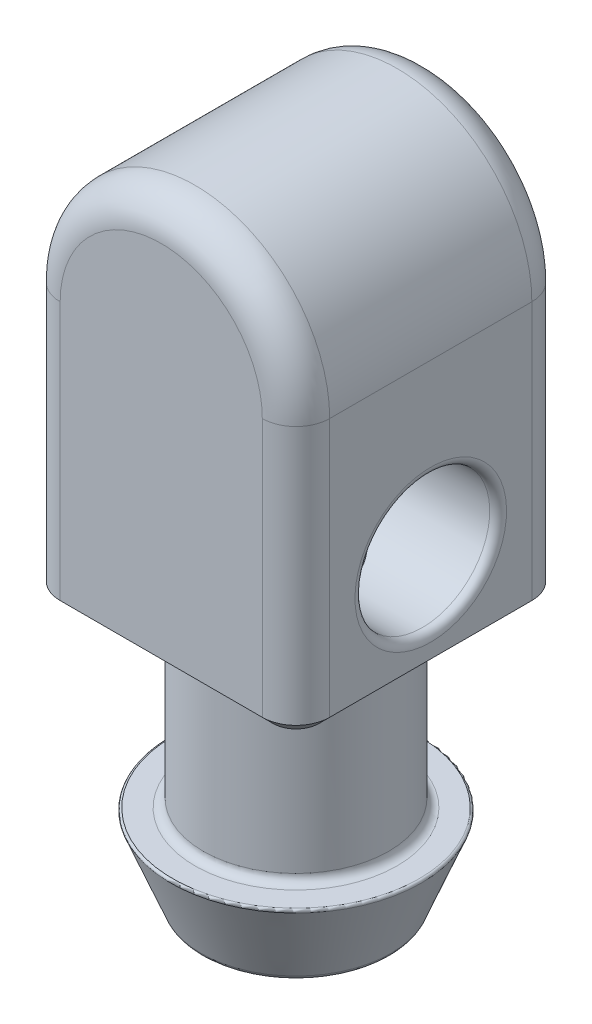
ISO-10303-21;
HEADER;
FILE_DESCRIPTION(('STEP AP214'),'2;1');
FILE_NAME('part.step','',(''),(''),'','','');
FILE_SCHEMA(('AUTOMOTIVE_DESIGN { 1 0 10303 214 1 1 1 1 }'));
ENDSEC;
DATA;
#1=APPLICATION_CONTEXT('core data for automotive mechanical design processes');
#2=APPLICATION_PROTOCOL_DEFINITION('international standard','automotive_design',2000,#1);
#3=PRODUCT_CONTEXT('',#1,'mechanical');
#4=PRODUCT('Part','Part','',(#3));
#5=PRODUCT_RELATED_PRODUCT_CATEGORY('part','',(#4));
#6=PRODUCT_DEFINITION_FORMATION('','',#4);
#7=PRODUCT_DEFINITION_CONTEXT('part definition',#1,'design');
#8=PRODUCT_DEFINITION('design','',#6,#7);
#9=PRODUCT_DEFINITION_SHAPE('','',#8);
#10=(LENGTH_UNIT() NAMED_UNIT(*) SI_UNIT(.MILLI.,.METRE.));
#11=(NAMED_UNIT(*) PLANE_ANGLE_UNIT() SI_UNIT($,.RADIAN.));
#12=(NAMED_UNIT(*) SI_UNIT($,.STERADIAN.) SOLID_ANGLE_UNIT());
#13=UNCERTAINTY_MEASURE_WITH_UNIT(LENGTH_MEASURE(1.E-05),#10,'distance_accuracy_value','');
#14=(GEOMETRIC_REPRESENTATION_CONTEXT(3) GLOBAL_UNCERTAINTY_ASSIGNED_CONTEXT((#13)) GLOBAL_UNIT_ASSIGNED_CONTEXT((#10,
#11,#12)) REPRESENTATION_CONTEXT('',''));
#15=CARTESIAN_POINT('',(0.,0.,0.));
#16=DIRECTION('',(0.,0.,1.));
#17=DIRECTION('',(1.,0.,0.));
#18=AXIS2_PLACEMENT_3D('',#15,#16,#17);
#19=CARTESIAN_POINT('',(0.,0.,6.35));
#20=DIRECTION('',(0.,0.,-1.));
#21=DIRECTION('',(-1.,0.,0.));
#22=AXIS2_PLACEMENT_3D('',#19,#20,#21);
#23=CYLINDRICAL_SURFACE('',#22,6.35);
#24=DIRECTION('',(0.,0.,-1.));
#25=VECTOR('',#24,1.);
#26=CARTESIAN_POINT('',(-6.35,0.,6.35));
#27=LINE('',#26,#25);
#28=CARTESIAN_POINT('',(-6.35,0.,4.7625));
#29=VERTEX_POINT('',#28);
#30=CARTESIAN_POINT('',(-6.35,0.,-4.7625));
#31=VERTEX_POINT('',#30);
#32=EDGE_CURVE('E154',#29,#31,#27,.T.);
#33=ORIENTED_EDGE('',*,*,#32,.F.);
#34=CARTESIAN_POINT('',(0.,0.,4.7625));
#35=DIRECTION('',(0.,0.,1.));
#36=DIRECTION('',(1.,0.,0.));
#37=AXIS2_PLACEMENT_3D('',#34,#35,#36);
#38=CIRCLE('',#37,6.35);
#39=CARTESIAN_POINT('',(6.35,0.,4.7625));
#40=VERTEX_POINT('',#39);
#41=EDGE_CURVE('E266',#29,#40,#38,.F.);
#42=ORIENTED_EDGE('',*,*,#41,.T.);
#43=DIRECTION('',(0.,0.,-1.));
#44=VECTOR('',#43,1.);
#45=CARTESIAN_POINT('',(6.35,0.,6.35));
#46=LINE('',#45,#44);
#47=CARTESIAN_POINT('',(6.35,0.,-4.7625));
#48=VERTEX_POINT('',#47);
#49=EDGE_CURVE('E276',#40,#48,#46,.T.);
#50=ORIENTED_EDGE('',*,*,#49,.T.);
#51=CARTESIAN_POINT('',(0.,0.,-4.7625));
#52=DIRECTION('',(0.,0.,1.));
#53=DIRECTION('',(1.,0.,0.));
#54=AXIS2_PLACEMENT_3D('',#51,#52,#53);
#55=CIRCLE('',#54,6.35);
#56=EDGE_CURVE('E264',#48,#31,#55,.T.);
#57=ORIENTED_EDGE('',*,*,#56,.T.);
#58=EDGE_LOOP('',(#33,#42,#50,#57));
#59=FACE_BOUND('',#58,.T.);
#60=ADVANCED_FACE('F35',(#59),#23,.T.);
#61=CARTESIAN_POINT('',(-6.35,0.,6.35));
#62=DIRECTION('',(1.,0.,0.));
#63=DIRECTION('',(0.,1.,0.));
#64=AXIS2_PLACEMENT_3D('',#61,#62,#63);
#65=PLANE('',#64);
#66=DIRECTION('',(0.,-1.,0.));
#67=VECTOR('',#66,1.);
#68=CARTESIAN_POINT('',(-6.35,0.,-4.7625));
#69=LINE('',#68,#67);
#70=CARTESIAN_POINT('',(-6.35,-12.192,-4.7625));
#71=VERTEX_POINT('',#70);
#72=EDGE_CURVE('E255',#31,#71,#69,.T.);
#73=ORIENTED_EDGE('',*,*,#72,.T.);
#74=DIRECTION('',(0.,0.,1.));
#75=VECTOR('',#74,1.);
#76=CARTESIAN_POINT('',(-6.35,-12.192,6.35));
#77=LINE('',#76,#75);
#78=CARTESIAN_POINT('',(-6.35,-12.192,4.7625));
#79=VERTEX_POINT('',#78);
#80=EDGE_CURVE('E336',#71,#79,#77,.T.);
#81=ORIENTED_EDGE('',*,*,#80,.T.);
#82=DIRECTION('',(0.,-1.,0.));
#83=VECTOR('',#82,1.);
#84=CARTESIAN_POINT('',(-6.35,0.,4.7625));
#85=LINE('',#84,#83);
#86=EDGE_CURVE('E253',#79,#29,#85,.F.);
#87=ORIENTED_EDGE('',*,*,#86,.T.);
#88=ORIENTED_EDGE('',*,*,#32,.T.);
#89=EDGE_LOOP('',(#73,#81,#87,#88));
#90=FACE_BOUND('',#89,.T.);
#91=ADVANCED_FACE('F185',(#90),#65,.F.);
#92=CARTESIAN_POINT('',(-6.35,-12.7,6.35));
#93=DIRECTION('',(0.,1.,0.));
#94=DIRECTION('',(0.,0.,1.));
#95=AXIS2_PLACEMENT_3D('',#92,#93,#94);
#96=PLANE('',#95);
#97=CARTESIAN_POINT('',(-4.7625,-12.7,-4.7625));
#98=DIRECTION('',(0.,1.,0.));
#99=DIRECTION('',(0.,0.,1.));
#100=AXIS2_PLACEMENT_3D('',#97,#98,#99);
#101=CIRCLE('',#100,1.0795);
#102=CARTESIAN_POINT('',(-5.842,-12.7,-4.7625));
#103=VERTEX_POINT('',#102);
#104=CARTESIAN_POINT('',(-4.7625,-12.7,-5.842));
#105=VERTEX_POINT('',#104);
#106=EDGE_CURVE('E324',#103,#105,#101,.F.);
#107=ORIENTED_EDGE('',*,*,#106,.T.);
#108=DIRECTION('',(1.,0.,0.));
#109=VECTOR('',#108,1.);
#110=CARTESIAN_POINT('',(-6.35,-12.7,-5.842));
#111=LINE('',#110,#109);
#112=CARTESIAN_POINT('',(4.7625,-12.7,-5.842));
#113=VERTEX_POINT('',#112);
#114=EDGE_CURVE('E326',#105,#113,#111,.T.);
#115=ORIENTED_EDGE('',*,*,#114,.T.);
#116=CARTESIAN_POINT('',(4.7625,-12.7,-4.7625));
#117=DIRECTION('',(0.,1.,0.));
#118=DIRECTION('',(0.,0.,1.));
#119=AXIS2_PLACEMENT_3D('',#116,#117,#118);
#120=CIRCLE('',#119,1.0795);
#121=CARTESIAN_POINT('',(5.842,-12.7,-4.7625));
#122=VERTEX_POINT('',#121);
#123=EDGE_CURVE('E322',#113,#122,#120,.F.);
#124=ORIENTED_EDGE('',*,*,#123,.T.);
#125=DIRECTION('',(0.,0.,1.));
#126=VECTOR('',#125,1.);
#127=CARTESIAN_POINT('',(5.842,-12.7,6.35));
#128=LINE('',#127,#126);
#129=CARTESIAN_POINT('',(5.842,-12.7,4.7625));
#130=VERTEX_POINT('',#129);
#131=EDGE_CURVE('E318',#122,#130,#128,.T.);
#132=ORIENTED_EDGE('',*,*,#131,.T.);
#133=CARTESIAN_POINT('',(4.7625,-12.7,4.7625));
#134=DIRECTION('',(0.,1.,0.));
#135=DIRECTION('',(0.,0.,1.));
#136=AXIS2_PLACEMENT_3D('',#133,#134,#135);
#137=CIRCLE('',#136,1.0795);
#138=CARTESIAN_POINT('',(4.7625,-12.7,5.842));
#139=VERTEX_POINT('',#138);
#140=EDGE_CURVE('E314',#130,#139,#137,.F.);
#141=ORIENTED_EDGE('',*,*,#140,.T.);
#142=DIRECTION('',(-1.,0.,0.));
#143=VECTOR('',#142,1.);
#144=CARTESIAN_POINT('',(-4.7625,-12.7,5.842));
#145=LINE('',#144,#143);
#146=CARTESIAN_POINT('',(-4.7625,-12.7,5.842));
#147=VERTEX_POINT('',#146);
#148=EDGE_CURVE('E312',#139,#147,#145,.T.);
#149=ORIENTED_EDGE('',*,*,#148,.T.);
#150=CARTESIAN_POINT('',(-4.7625,-12.7,4.7625));
#151=DIRECTION('',(0.,1.,0.));
#152=DIRECTION('',(0.,0.,1.));
#153=AXIS2_PLACEMENT_3D('',#150,#151,#152);
#154=CIRCLE('',#153,1.0795);
#155=CARTESIAN_POINT('',(-5.842,-12.7,4.7625));
#156=VERTEX_POINT('',#155);
#157=EDGE_CURVE('E316',#147,#156,#154,.F.);
#158=ORIENTED_EDGE('',*,*,#157,.T.);
#159=DIRECTION('',(0.,0.,-1.));
#160=VECTOR('',#159,1.);
#161=CARTESIAN_POINT('',(-5.842,-12.7,6.35));
#162=LINE('',#161,#160);
#163=EDGE_CURVE('E320',#156,#103,#162,.T.);
#164=ORIENTED_EDGE('',*,*,#163,.T.);
#165=EDGE_LOOP('',(#107,#115,#124,#132,#141,#149,#158,#164));
#166=FACE_BOUND('',#165,.T.);
#167=CARTESIAN_POINT('',(0.,-12.7,0.));
#168=DIRECTION('',(0.,1.,0.));
#169=DIRECTION('',(0.,0.,1.));
#170=AXIS2_PLACEMENT_3D('',#167,#168,#169);
#171=CIRCLE('',#170,4.7625);
#172=CARTESIAN_POINT('',(0.,-12.7,4.7625));
#173=VERTEX_POINT('',#172);
#174=EDGE_CURVE('E288',#173,#173,#171,.T.);
#175=ORIENTED_EDGE('',*,*,#174,.T.);
#176=EDGE_LOOP('',(#175));
#177=FACE_BOUND('',#176,.T.);
#178=ADVANCED_FACE('F189',(#166,#177),#96,.F.);
#179=CARTESIAN_POINT('',(6.35,-12.7,6.35));
#180=DIRECTION('',(-1.,0.,0.));
#181=DIRECTION('',(0.,-1.,0.));
#182=AXIS2_PLACEMENT_3D('',#179,#180,#181);
#183=PLANE('',#182);
#184=CARTESIAN_POINT('',(6.35,-7.9375,0.));
#185=DIRECTION('',(-1.,0.,0.));
#186=DIRECTION('',(0.,-1.,0.));
#187=AXIS2_PLACEMENT_3D('',#184,#185,#186);
#188=CIRCLE('',#187,3.571875);
#189=CARTESIAN_POINT('',(6.35,-11.509375,0.));
#190=VERTEX_POINT('',#189);
#191=EDGE_CURVE('E285',#190,#190,#188,.T.);
#192=ORIENTED_EDGE('',*,*,#191,.T.);
#193=EDGE_LOOP('',(#192));
#194=FACE_BOUND('',#193,.T.);
#195=DIRECTION('',(0.,1.,0.));
#196=VECTOR('',#195,1.);
#197=CARTESIAN_POINT('',(6.35,-12.7,4.7625));
#198=LINE('',#197,#196);
#199=CARTESIAN_POINT('',(6.35,-12.192,4.7625));
#200=VERTEX_POINT('',#199);
#201=EDGE_CURVE('E240',#40,#200,#198,.F.);
#202=ORIENTED_EDGE('',*,*,#201,.T.);
#203=DIRECTION('',(0.,0.,-1.));
#204=VECTOR('',#203,1.);
#205=CARTESIAN_POINT('',(6.35,-12.192,6.35));
#206=LINE('',#205,#204);
#207=CARTESIAN_POINT('',(6.35,-12.192,-4.7625));
#208=VERTEX_POINT('',#207);
#209=EDGE_CURVE('E338',#200,#208,#206,.T.);
#210=ORIENTED_EDGE('',*,*,#209,.T.);
#211=DIRECTION('',(0.,1.,0.));
#212=VECTOR('',#211,1.);
#213=CARTESIAN_POINT('',(6.35,-12.7,-4.7625));
#214=LINE('',#213,#212);
#215=EDGE_CURVE('E242',#208,#48,#214,.T.);
#216=ORIENTED_EDGE('',*,*,#215,.T.);
#217=ORIENTED_EDGE('',*,*,#49,.F.);
#218=EDGE_LOOP('',(#202,#210,#216,#217));
#219=FACE_BOUND('',#218,.T.);
#220=ADVANCED_FACE('F193',(#194,#219),#183,.F.);
#221=CARTESIAN_POINT('',(0.,0.,6.35));
#222=DIRECTION('',(0.,0.,1.));
#223=DIRECTION('',(1.,0.,0.));
#224=AXIS2_PLACEMENT_3D('',#221,#222,#223);
#225=PLANE('',#224);
#226=DIRECTION('',(0.,-1.,0.));
#227=VECTOR('',#226,1.);
#228=CARTESIAN_POINT('',(-4.7625,-12.7,6.35));
#229=LINE('',#228,#227);
#230=CARTESIAN_POINT('',(-4.7625,0.,6.35));
#231=VERTEX_POINT('',#230);
#232=CARTESIAN_POINT('',(-4.7625,-12.192,6.35));
#233=VERTEX_POINT('',#232);
#234=EDGE_CURVE('E262',#231,#233,#229,.T.);
#235=ORIENTED_EDGE('',*,*,#234,.T.);
#236=DIRECTION('',(1.,0.,0.));
#237=VECTOR('',#236,1.);
#238=CARTESIAN_POINT('',(4.7625,-12.192,6.35));
#239=LINE('',#238,#237);
#240=CARTESIAN_POINT('',(4.7625,-12.192,6.35));
#241=VERTEX_POINT('',#240);
#242=EDGE_CURVE('E50',#233,#241,#239,.T.);
#243=ORIENTED_EDGE('',*,*,#242,.T.);
#244=DIRECTION('',(0.,1.,0.));
#245=VECTOR('',#244,1.);
#246=CARTESIAN_POINT('',(4.7625,0.,6.35));
#247=LINE('',#246,#245);
#248=CARTESIAN_POINT('',(4.7625,0.,6.35));
#249=VERTEX_POINT('',#248);
#250=EDGE_CURVE('E258',#241,#249,#247,.T.);
#251=ORIENTED_EDGE('',*,*,#250,.T.);
#252=CARTESIAN_POINT('',(0.,0.,6.35));
#253=DIRECTION('',(0.,0.,1.));
#254=DIRECTION('',(1.,0.,0.));
#255=AXIS2_PLACEMENT_3D('',#252,#253,#254);
#256=CIRCLE('',#255,4.7625);
#257=EDGE_CURVE('E260',#249,#231,#256,.T.);
#258=ORIENTED_EDGE('',*,*,#257,.T.);
#259=EDGE_LOOP('',(#235,#243,#251,#258));
#260=FACE_BOUND('',#259,.T.);
#261=ADVANCED_FACE('F197',(#260),#225,.T.);
#262=CARTESIAN_POINT('',(0.,0.,-6.35));
#263=DIRECTION('',(0.,0.,1.));
#264=DIRECTION('',(1.,0.,0.));
#265=AXIS2_PLACEMENT_3D('',#262,#263,#264);
#266=PLANE('',#265);
#267=DIRECTION('',(0.,1.,0.));
#268=VECTOR('',#267,1.);
#269=CARTESIAN_POINT('',(4.7625,0.,-6.35));
#270=LINE('',#269,#268);
#271=CARTESIAN_POINT('',(4.7625,0.,-6.35));
#272=VERTEX_POINT('',#271);
#273=CARTESIAN_POINT('',(4.7625,-12.192,-6.35));
#274=VERTEX_POINT('',#273);
#275=EDGE_CURVE('E250',#272,#274,#270,.F.);
#276=ORIENTED_EDGE('',*,*,#275,.T.);
#277=DIRECTION('',(-1.,0.,0.));
#278=VECTOR('',#277,1.);
#279=CARTESIAN_POINT('',(0.,-12.192,-6.35));
#280=LINE('',#279,#278);
#281=CARTESIAN_POINT('',(-4.7625,-12.192,-6.35));
#282=VERTEX_POINT('',#281);
#283=EDGE_CURVE('E329',#274,#282,#280,.T.);
#284=ORIENTED_EDGE('',*,*,#283,.T.);
#285=DIRECTION('',(0.,-1.,0.));
#286=VECTOR('',#285,1.);
#287=CARTESIAN_POINT('',(-4.7625,0.,-6.35));
#288=LINE('',#287,#286);
#289=CARTESIAN_POINT('',(-4.7625,0.,-6.35));
#290=VERTEX_POINT('',#289);
#291=EDGE_CURVE('E248',#282,#290,#288,.F.);
#292=ORIENTED_EDGE('',*,*,#291,.T.);
#293=CARTESIAN_POINT('',(0.,0.,-6.35));
#294=DIRECTION('',(0.,0.,1.));
#295=DIRECTION('',(1.,0.,0.));
#296=AXIS2_PLACEMENT_3D('',#293,#294,#295);
#297=CIRCLE('',#296,4.7625);
#298=EDGE_CURVE('E246',#290,#272,#297,.F.);
#299=ORIENTED_EDGE('',*,*,#298,.T.);
#300=EDGE_LOOP('',(#276,#284,#292,#299));
#301=FACE_BOUND('',#300,.T.);
#302=ADVANCED_FACE('F199',(#301),#266,.F.);
#303=CARTESIAN_POINT('',(0.,9.54404991046198,0.));
#304=DIRECTION('',(0.,1.,0.));
#305=DIRECTION('',(-1.,0.,0.));
#306=AXIS2_PLACEMENT_3D('',#303,#304,#305);
#307=CYLINDRICAL_SURFACE('',#306,4.365625);
#308=CARTESIAN_POINT('',(0.,-13.096875,0.));
#309=DIRECTION('',(0.,1.,0.));
#310=DIRECTION('',(0.,0.,1.));
#311=AXIS2_PLACEMENT_3D('',#308,#309,#310);
#312=CIRCLE('',#311,4.365625);
#313=CARTESIAN_POINT('',(0.,-13.096875,4.365625));
#314=VERTEX_POINT('',#313);
#315=EDGE_CURVE('E294',#314,#314,#312,.F.);
#316=ORIENTED_EDGE('',*,*,#315,.T.);
#317=EDGE_LOOP('',(#316));
#318=FACE_BOUND('',#317,.T.);
#319=CARTESIAN_POINT('',(0.,-21.034375,0.));
#320=DIRECTION('',(0.,-1.,0.));
#321=DIRECTION('',(1.,0.,0.));
#322=AXIS2_PLACEMENT_3D('',#319,#320,#321);
#323=CIRCLE('',#322,4.365625);
#324=CARTESIAN_POINT('',(4.365625,-21.034375,0.));
#325=VERTEX_POINT('',#324);
#326=EDGE_CURVE('E291',#325,#325,#323,.F.);
#327=ORIENTED_EDGE('',*,*,#326,.T.);
#328=EDGE_LOOP('',(#327));
#329=FACE_BOUND('',#328,.T.);
#330=ADVANCED_FACE('F202',(#318,#329),#307,.T.);
#331=CARTESIAN_POINT('',(5.953125,-21.43125,0.));
#332=DIRECTION('',(0.,-1.,0.));
#333=DIRECTION('',(1.,0.,0.));
#334=AXIS2_PLACEMENT_3D('',#331,#332,#333);
#335=PLANE('',#334);
#336=CARTESIAN_POINT('',(0.,-21.43125,0.));
#337=DIRECTION('',(0.,-1.,0.));
#338=DIRECTION('',(1.,0.,0.));
#339=AXIS2_PLACEMENT_3D('',#336,#337,#338);
#340=CIRCLE('',#339,5.80657563585842);
#341=CARTESIAN_POINT('',(5.80657563585843,-21.43125,0.));
#342=VERTEX_POINT('',#341);
#343=EDGE_CURVE('E306',#342,#342,#340,.F.);
#344=ORIENTED_EDGE('',*,*,#343,.T.);
#345=EDGE_LOOP('',(#344));
#346=FACE_BOUND('',#345,.T.);
#347=CARTESIAN_POINT('',(0.,-21.43125,0.));
#348=DIRECTION('',(0.,-1.,0.));
#349=DIRECTION('',(1.,0.,0.));
#350=AXIS2_PLACEMENT_3D('',#347,#348,#349);
#351=CIRCLE('',#350,4.7625);
#352=CARTESIAN_POINT('',(4.7625,-21.43125,0.));
#353=VERTEX_POINT('',#352);
#354=EDGE_CURVE('E303',#353,#353,#351,.T.);
#355=ORIENTED_EDGE('',*,*,#354,.T.);
#356=EDGE_LOOP('',(#355));
#357=FACE_BOUND('',#356,.T.);
#358=ADVANCED_FACE('F208',(#346,#357),#335,.F.);
#359=CARTESIAN_POINT('',(0.,-25.4,0.));
#360=DIRECTION('',(0.,1.,0.));
#361=DIRECTION('',(-1.,0.,0.));
#362=AXIS2_PLACEMENT_3D('',#359,#360,#361);
#363=CONICAL_SURFACE('',#362,4.365625,0.380506377112365);
#364=CARTESIAN_POINT('',(0.,-21.5673176686695,0.));
#365=DIRECTION('',(0.,-1.,0.));
#366=DIRECTION('',(1.,0.,0.));
#367=AXIS2_PLACEMENT_3D('',#364,#365,#366);
#368=CIRCLE('',#367,5.8986979325322);
#369=CARTESIAN_POINT('',(5.8986979325322,-21.5673176686695,0.));
#370=VERTEX_POINT('',#369);
#371=EDGE_CURVE('E309',#370,#370,#368,.T.);
#372=ORIENTED_EDGE('',*,*,#371,.T.);
#373=EDGE_LOOP('',(#372));
#374=FACE_BOUND('',#373,.T.);
#375=CARTESIAN_POINT('',(0.,-25.150520674678,0.));
#376=DIRECTION('',(0.,-1.,0.));
#377=DIRECTION('',(1.,0.,0.));
#378=AXIS2_PLACEMENT_3D('',#375,#376,#377);
#379=CIRCLE('',#378,4.46541673012878);
#380=CARTESIAN_POINT('',(4.46541673012879,-25.150520674678,0.));
#381=VERTEX_POINT('',#380);
#382=EDGE_CURVE('E297',#381,#381,#379,.F.);
#383=ORIENTED_EDGE('',*,*,#382,.T.);
#384=EDGE_LOOP('',(#383));
#385=FACE_BOUND('',#384,.T.);
#386=ADVANCED_FACE('F212',(#374,#385),#363,.T.);
#387=CARTESIAN_POINT('',(0.,-25.4,0.));
#388=DIRECTION('',(0.,1.,0.));
#389=DIRECTION('',(-1.,0.,0.));
#390=AXIS2_PLACEMENT_3D('',#387,#388,#389);
#391=PLANE('',#390);
#392=CARTESIAN_POINT('',(0.,-25.4,0.));
#393=DIRECTION('',(0.,1.,0.));
#394=DIRECTION('',(-1.,0.,0.));
#395=AXIS2_PLACEMENT_3D('',#392,#393,#394);
#396=CIRCLE('',#395,2.63525);
#397=CARTESIAN_POINT('',(-2.63525,-25.4,0.));
#398=VERTEX_POINT('',#397);
#399=EDGE_CURVE('E11',#398,#398,#396,.T.);
#400=ORIENTED_EDGE('',*,*,#399,.T.);
#401=EDGE_LOOP('',(#400));
#402=FACE_BOUND('',#401,.T.);
#403=CARTESIAN_POINT('',(0.,-25.4,0.));
#404=DIRECTION('',(0.,1.,0.));
#405=DIRECTION('',(-1.,0.,0.));
#406=AXIS2_PLACEMENT_3D('',#403,#404,#405);
#407=CIRCLE('',#406,4.0969275434337);
#408=CARTESIAN_POINT('',(-4.09692754343369,-25.4,0.));
#409=VERTEX_POINT('',#408);
#410=EDGE_CURVE('E300',#409,#409,#407,.F.);
#411=ORIENTED_EDGE('',*,*,#410,.T.);
#412=EDGE_LOOP('',(#411));
#413=FACE_BOUND('',#412,.T.);
#414=ADVANCED_FACE('F216',(#402,#413),#391,.F.);
#415=CARTESIAN_POINT('',(0.,-4.445,0.));
#416=DIRECTION('',(0.,-1.,0.));
#417=DIRECTION('',(1.,0.,0.));
#418=AXIS2_PLACEMENT_3D('',#415,#416,#417);
#419=CYLINDRICAL_SURFACE('',#418,2.38125);
#420=CARTESIAN_POINT('',(0.,-25.146,0.));
#421=DIRECTION('',(0.,1.,0.));
#422=DIRECTION('',(-1.,0.,0.));
#423=AXIS2_PLACEMENT_3D('',#420,#421,#422);
#424=CIRCLE('',#423,2.38125);
#425=CARTESIAN_POINT('',(-2.38125,-25.146,0.));
#426=VERTEX_POINT('',#425);
#427=EDGE_CURVE('E43',#426,#426,#424,.F.);
#428=ORIENTED_EDGE('',*,*,#427,.T.);
#429=EDGE_LOOP('',(#428));
#430=FACE_BOUND('',#429,.T.);
#431=DIRECTION('',(0.,-1.,0.));
#432=VECTOR('',#431,1.);
#433=CARTESIAN_POINT('',(0.,-4.445,2.38125));
#434=LINE('',#433,#432);
#435=CARTESIAN_POINT('',(0.,-5.83743489684248,2.38125));
#436=VERTEX_POINT('',#435);
#437=CARTESIAN_POINT('',(0.,-10.0375651031575,2.38125));
#438=VERTEX_POINT('',#437);
#439=EDGE_CURVE('E151',#436,#438,#434,.T.);
#440=ORIENTED_EDGE('',*,*,#439,.T.);
#441=CARTESIAN_POINT('',(0.,-10.0375651031575,2.38125));
#442=CARTESIAN_POINT('',(0.0561245204626832,-10.0375199990338,2.38126822591326));
#443=CARTESIAN_POINT('',(0.112217936450534,-10.0398138880496,2.37926667902177));
#444=CARTESIAN_POINT('',(0.223671131800707,-10.0487255970175,2.37137379316888));
#445=CARTESIAN_POINT('',(0.279032194996815,-10.0553344084856,2.3654905579373));
#446=CARTESIAN_POINT('',(0.387884978838999,-10.0724143762014,2.35008236997963));
#447=CARTESIAN_POINT('',(0.441391567733993,-10.0828349130722,2.34060508787382));
#448=CARTESIAN_POINT('',(0.546919518007049,-10.1070060541126,2.3182195976222));
#449=CARTESIAN_POINT('',(0.598940153510206,-10.1207582556915,2.3053097433952));
#450=CARTESIAN_POINT('',(0.751534924408193,-10.1658815236044,2.26200339698975));
#451=CARTESIAN_POINT('',(0.849608113325894,-10.2012899805844,2.22688661842265));
#452=CARTESIAN_POINT('',(1.03844243716203,-10.2786886649226,2.14537500926353));
#453=CARTESIAN_POINT('',(1.12917473535362,-10.3207031053161,2.09893832866164));
#454=CARTESIAN_POINT('',(1.32102133065951,-10.4168383299631,1.98497914839555));
#455=CARTESIAN_POINT('',(1.42037879098329,-10.4716613144675,1.91508043201811));
#456=CARTESIAN_POINT('',(1.6074630040206,-10.5810717520447,1.76100176797155));
#457=CARTESIAN_POINT('',(1.69518316783346,-10.6356590549001,1.67681379085378));
#458=CARTESIAN_POINT('',(1.87462102679173,-10.7515485183125,1.47572607359863));
#459=CARTESIAN_POINT('',(1.96348368484389,-10.8119390276784,1.35565776027188));
#460=CARTESIAN_POINT('',(2.07995067475326,-10.8931242446674,1.16182596336741));
#461=CARTESIAN_POINT('',(2.11596084801556,-10.9186134580693,1.0949475955199));
#462=CARTESIAN_POINT('',(2.18183943217687,-10.9657276874002,0.956958592406277));
#463=CARTESIAN_POINT('',(2.21171109308475,-10.9873547473312,0.885850222546187));
#464=CARTESIAN_POINT('',(2.2751903509341,-11.0336459215586,0.711037620931384));
#465=CARTESIAN_POINT('',(2.30561022211595,-11.0561334044784,0.60555590665498));
#466=CARTESIAN_POINT('',(2.35171442271465,-11.0903709285524,0.389800020485862));
#467=CARTESIAN_POINT('',(2.36741185630508,-11.1021305181537,0.27953020205852));
#468=CARTESIAN_POINT('',(2.38318754229739,-11.1139489159427,0.0569391828892785));
#469=CARTESIAN_POINT('',(2.38322504654385,-11.1139771985045,-0.0553866090504566));
#470=CARTESIAN_POINT('',(2.36756954818876,-11.1022484742002,-0.278315311974214));
#471=CARTESIAN_POINT('',(2.35187290478792,-11.0904887396487,-0.388917818183467));
#472=CARTESIAN_POINT('',(2.30650884387949,-11.0568006189697,-0.601485685574161));
#473=CARTESIAN_POINT('',(2.27733842670869,-11.0352343683786,-0.703617131533976));
#474=CARTESIAN_POINT('',(2.20663249691488,-10.9836315964871,-0.901191583497152));
#475=CARTESIAN_POINT('',(2.16509412717692,-10.9535931181059,-0.996633037748003));
#476=CARTESIAN_POINT('',(2.06608188706008,-10.8832799365336,-1.18938639295879));
#477=CARTESIAN_POINT('',(2.00736926591633,-10.8422488956257,-1.28578107502139));
#478=CARTESIAN_POINT('',(1.87842893240889,-10.7546844657131,-1.46775821831135));
#479=CARTESIAN_POINT('',(1.80819243234914,-10.7081468852298,-1.55333233929582));
#480=CARTESIAN_POINT('',(1.64273283545676,-10.6028294114422,-1.72889128687876));
#481=CARTESIAN_POINT('',(1.54531170784179,-10.5434404684567,-1.81644032804883));
#482=CARTESIAN_POINT('',(1.33699909294703,-10.4255569040559,-1.97482472950788));
#483=CARTESIAN_POINT('',(1.22609386448133,-10.3670632645047,-2.0456428199291));
#484=CARTESIAN_POINT('',(1.01431202025676,-10.2681981735767,-2.15705499232983));
#485=CARTESIAN_POINT('',(0.915737677868905,-10.2265229229147,-2.20085296944568));
#486=CARTESIAN_POINT('',(0.710804233739922,-10.1525565230384,-2.27528021631636));
#487=CARTESIAN_POINT('',(0.604486562768773,-10.1202194516305,-2.305974296511));
#488=CARTESIAN_POINT('',(0.415239153164291,-10.0768247927605,-2.34617702404322));
#489=CARTESIAN_POINT('',(0.333855714231582,-10.0623671783983,-2.35918264551421));
#490=CARTESIAN_POINT('',(0.209944251882716,-10.0476280861825,-2.37234598380837));
#491=CARTESIAN_POINT('',(0.168140921918844,-10.0438719563849,-2.37567669747619));
#492=CARTESIAN_POINT('',(0.0842309584643913,-10.0388335133902,-2.38013182399314));
#493=CARTESIAN_POINT('',(0.0421240818440672,-10.0375534735094,-2.38125420937605));
#494=CARTESIAN_POINT('',(0.,-10.0375651031575,-2.38125));
#495=B_SPLINE_CURVE_WITH_KNOTS('',3,(#441,#442,#443,#444,#445,#446,#447,#448,#449,#450,#451,
#452,#453,#454,#455,#456,#457,#458,#459,#460,#461,#462,#463,#464,#465,#466,#467,#468,#469,#470,
#471,#472,#473,#474,#475,#476,#477,#478,#479,#480,#481,#482,#483,#484,#485,#486,#487,#488,#489,
#490,#491,#492,#493,#494),.UNSPECIFIED.,.F.,.F.,(4,2,2,2,2,2,2,2,2,2,2,2,2,2,2,2,2,2,2,2,2,2,2,
2,2,2,4),(0.,0.168241173677989,0.336132220007072,0.501870155955781,0.667687714904018,
0.996386770493256,1.32631997381257,1.72476883698948,2.12344234308732,2.60369524887319,
2.8436886029201,3.08355456427888,3.418200114306,3.75254751895379,4.08776491190293,
4.42305989030957,4.74686905065838,5.07075307212353,5.42972003643331,5.78896201927358,
6.21877389835658,6.64902751422674,6.99485698826582,7.33895563468913,7.58904138540621,
7.71523197173619,7.84153835968297),.UNSPECIFIED.);
#496=CARTESIAN_POINT('',(0.,-10.0375651031575,-2.38125));
#497=VERTEX_POINT('',#496);
#498=EDGE_CURVE('E145',#438,#497,#495,.T.);
#499=ORIENTED_EDGE('',*,*,#498,.T.);
#500=DIRECTION('',(0.,-1.,0.));
#501=VECTOR('',#500,1.);
#502=CARTESIAN_POINT('',(0.,-4.445,-2.38125));
#503=LINE('',#502,#501);
#504=CARTESIAN_POINT('',(0.,-5.83743489684248,-2.38125));
#505=VERTEX_POINT('',#504);
#506=EDGE_CURVE('E159',#497,#505,#503,.F.);
#507=ORIENTED_EDGE('',*,*,#506,.T.);
#508=CARTESIAN_POINT('',(0.,-5.83743489684248,-2.38125));
#509=CARTESIAN_POINT('',(0.0561245204626825,-5.83748000096622,-2.38126822591326));
#510=CARTESIAN_POINT('',(0.112217936450533,-5.83518611195037,-2.37926667902177));
#511=CARTESIAN_POINT('',(0.223671131800707,-5.82627440298248,-2.37137379316888));
#512=CARTESIAN_POINT('',(0.279032194996814,-5.81966559151444,-2.3654905579373));
#513=CARTESIAN_POINT('',(0.387884978838999,-5.80258562379861,-2.35008236997963));
#514=CARTESIAN_POINT('',(0.441391567733993,-5.79216508692778,-2.34060508787382));
#515=CARTESIAN_POINT('',(0.546919518007049,-5.76799394588741,-2.3182195976222));
#516=CARTESIAN_POINT('',(0.598940153510205,-5.75424174430846,-2.3053097433952));
#517=CARTESIAN_POINT('',(0.751534924408193,-5.70911847639559,-2.26200339698975));
#518=CARTESIAN_POINT('',(0.849608113325894,-5.67371001941558,-2.22688661842265));
#519=CARTESIAN_POINT('',(1.03844243716203,-5.59631133507735,-2.14537500926353));
#520=CARTESIAN_POINT('',(1.12917473535362,-5.55429689468391,-2.09893832866164));
#521=CARTESIAN_POINT('',(1.32102133065951,-5.45816167003695,-1.98497914839555));
#522=CARTESIAN_POINT('',(1.42037879098329,-5.40333868553251,-1.91508043201811));
#523=CARTESIAN_POINT('',(1.6074630040206,-5.29392824795531,-1.76100176797155));
#524=CARTESIAN_POINT('',(1.69518316783346,-5.23934094509987,-1.67681379085378));
#525=CARTESIAN_POINT('',(1.87462102679173,-5.12345148168746,-1.47572607359863));
#526=CARTESIAN_POINT('',(1.96348368484389,-5.0630609723216,-1.35565776027188));
#527=CARTESIAN_POINT('',(2.07995067475326,-4.98187575533262,-1.16182596336741));
#528=CARTESIAN_POINT('',(2.11596084801556,-4.95638654193072,-1.0949475955199));
#529=CARTESIAN_POINT('',(2.18183943217687,-4.90927231259976,-0.956958592406276));
#530=CARTESIAN_POINT('',(2.21171109308475,-4.88764525266884,-0.885850222546186));
#531=CARTESIAN_POINT('',(2.2751903509341,-4.84135407844145,-0.711037620931383));
#532=CARTESIAN_POINT('',(2.30561022211594,-4.81886659552161,-0.605555906654979));
#533=CARTESIAN_POINT('',(2.35171442271465,-4.78462907144764,-0.389800020485861));
#534=CARTESIAN_POINT('',(2.36741185630508,-4.77286948184627,-0.279530202058519));
#535=CARTESIAN_POINT('',(2.38318754229739,-4.76105108405733,-0.0569391828892775));
#536=CARTESIAN_POINT('',(2.38322504654385,-4.7610228014955,0.0553866090504575));
#537=CARTESIAN_POINT('',(2.36756954818876,-4.77275152579977,0.278315311974215));
#538=CARTESIAN_POINT('',(2.35187290478792,-4.78451126035126,0.388917818183468));
#539=CARTESIAN_POINT('',(2.30650884387949,-4.81819938103029,0.601485685574162));
#540=CARTESIAN_POINT('',(2.27733842670869,-4.8397656316214,0.703617131533977));
#541=CARTESIAN_POINT('',(2.20663249691488,-4.89136840351293,0.901191583497153));
#542=CARTESIAN_POINT('',(2.16509412717692,-4.9214068818941,0.996633037748004));
#543=CARTESIAN_POINT('',(2.06608188706008,-4.99172006346643,1.1893863929588));
#544=CARTESIAN_POINT('',(2.00736926591633,-5.03275110437427,1.28578107502139));
#545=CARTESIAN_POINT('',(1.87842893240889,-5.12031553428686,1.46775821831135));
#546=CARTESIAN_POINT('',(1.80819243234914,-5.16685311477021,1.55333233929582));
#547=CARTESIAN_POINT('',(1.64273283545676,-5.2721705885578,1.72889128687876));
#548=CARTESIAN_POINT('',(1.54531170784179,-5.33155953154327,1.81644032804883));
#549=CARTESIAN_POINT('',(1.33699909294703,-5.4494430959441,1.97482472950788));
#550=CARTESIAN_POINT('',(1.22609386448132,-5.50793673549533,2.0456428199291));
#551=CARTESIAN_POINT('',(1.01431202025676,-5.60680182642326,2.15705499232983));
#552=CARTESIAN_POINT('',(0.915737677868903,-5.6484770770853,2.20085296944568));
#553=CARTESIAN_POINT('',(0.710804233739921,-5.72244347696158,2.27528021631636));
#554=CARTESIAN_POINT('',(0.604486562768772,-5.75478054836953,2.305974296511));
#555=CARTESIAN_POINT('',(0.41523915316429,-5.79817520723953,2.34617702404322));
#556=CARTESIAN_POINT('',(0.333855714231581,-5.81263282160171,2.35918264551421));
#557=CARTESIAN_POINT('',(0.209944251882715,-5.82737191381752,2.37234598380837));
#558=CARTESIAN_POINT('',(0.168140921918843,-5.83112804361512,2.37567669747619));
#559=CARTESIAN_POINT('',(0.0842309584643904,-5.83616648660983,2.38013182399314));
#560=CARTESIAN_POINT('',(0.0421240818440664,-5.83744652649062,2.38125420937605));
#561=CARTESIAN_POINT('',(0.,-5.83743489684248,2.38125));
#562=B_SPLINE_CURVE_WITH_KNOTS('',3,(#508,#509,#510,#511,#512,#513,#514,#515,#516,#517,#518,
#519,#520,#521,#522,#523,#524,#525,#526,#527,#528,#529,#530,#531,#532,#533,#534,#535,#536,#537,
#538,#539,#540,#541,#542,#543,#544,#545,#546,#547,#548,#549,#550,#551,#552,#553,#554,#555,#556,
#557,#558,#559,#560,#561),.UNSPECIFIED.,.F.,.F.,(4,2,2,2,2,2,2,2,2,2,2,2,2,2,2,2,2,2,2,2,2,2,2,
2,2,2,4),(0.,0.168241173677989,0.336132220007072,0.501870155955782,0.667687714904018,
0.996386770493256,1.32631997381257,1.72476883698947,2.12344234308732,2.60369524887319,
2.8436886029201,3.08355456427888,3.418200114306,3.75254751895379,4.08776491190293,
4.42305989030957,4.74686905065838,5.07075307212353,5.42972003643331,5.78896201927358,
6.21877389835659,6.64902751422674,6.99485698826582,7.33895563468913,7.58904138540621,
7.71523197173619,7.84153835968297),.UNSPECIFIED.);
#563=EDGE_CURVE('E142',#505,#436,#562,.T.);
#564=ORIENTED_EDGE('',*,*,#563,.T.);
#565=EDGE_LOOP('',(#440,#499,#507,#564));
#566=FACE_BOUND('',#565,.T.);
#567=CARTESIAN_POINT('',(0.,-4.445,0.));
#568=DIRECTION('',(0.,-1.,0.));
#569=DIRECTION('',(1.,0.,0.));
#570=AXIS2_PLACEMENT_3D('',#567,#568,#569);
#571=CIRCLE('',#570,2.38125);
#572=CARTESIAN_POINT('',(2.38125,-4.445,0.));
#573=VERTEX_POINT('',#572);
#574=EDGE_CURVE('E149',#573,#573,#571,.T.);
#575=ORIENTED_EDGE('',*,*,#574,.F.);
#576=EDGE_LOOP('',(#575));
#577=FACE_BOUND('',#576,.T.);
#578=ADVANCED_FACE('F157',(#430,#566,#577),#419,.F.);
#579=CARTESIAN_POINT('',(0.,-4.445,0.));
#580=DIRECTION('',(0.,-1.,0.));
#581=DIRECTION('',(1.,0.,0.));
#582=AXIS2_PLACEMENT_3D('',#579,#580,#581);
#583=PLANE('',#582);
#584=ORIENTED_EDGE('',*,*,#574,.T.);
#585=EDGE_LOOP('',(#584));
#586=FACE_BOUND('',#585,.T.);
#587=ADVANCED_FACE('F221',(#586),#583,.T.);
#588=CARTESIAN_POINT('',(6.35,-7.9375,0.));
#589=DIRECTION('',(1.,0.,0.));
#590=DIRECTION('',(0.,0.,-1.));
#591=AXIS2_PLACEMENT_3D('',#588,#589,#590);
#592=CYLINDRICAL_SURFACE('',#591,3.175);
#593=CARTESIAN_POINT('',(5.953125,-7.9375,0.));
#594=DIRECTION('',(-1.,0.,0.));
#595=DIRECTION('',(0.,-1.,0.));
#596=AXIS2_PLACEMENT_3D('',#593,#594,#595);
#597=CIRCLE('',#596,3.175);
#598=CARTESIAN_POINT('',(5.953125,-11.1125,0.));
#599=VERTEX_POINT('',#598);
#600=EDGE_CURVE('E268',#599,#599,#597,.F.);
#601=ORIENTED_EDGE('',*,*,#600,.T.);
#602=EDGE_LOOP('',(#601));
#603=FACE_BOUND('',#602,.T.);
#604=CARTESIAN_POINT('',(0.,-7.9375,0.));
#605=DIRECTION('',(1.,0.,0.));
#606=DIRECTION('',(0.,0.,-1.));
#607=AXIS2_PLACEMENT_3D('',#604,#605,#606);
#608=CIRCLE('',#607,3.175);
#609=EDGE_CURVE('E137',#436,#438,#608,.T.);
#610=ORIENTED_EDGE('',*,*,#609,.F.);
#611=ORIENTED_EDGE('',*,*,#563,.F.);
#612=EDGE_CURVE('E148',#497,#505,#608,.T.);
#613=ORIENTED_EDGE('',*,*,#612,.F.);
#614=ORIENTED_EDGE('',*,*,#498,.F.);
#615=EDGE_LOOP('',(#610,#611,#613,#614));
#616=FACE_BOUND('',#615,.T.);
#617=ADVANCED_FACE('F139',(#603,#616),#592,.F.);
#618=CARTESIAN_POINT('',(0.,-6.35,0.));
#619=DIRECTION('',(-1.,0.,0.));
#620=DIRECTION('',(0.,0.,1.));
#621=AXIS2_PLACEMENT_3D('',#618,#619,#620);
#622=PLANE('',#621);
#623=ORIENTED_EDGE('',*,*,#609,.T.);
#624=ORIENTED_EDGE('',*,*,#439,.F.);
#625=EDGE_LOOP('',(#623,#624));
#626=FACE_BOUND('',#625,.T.);
#627=ADVANCED_FACE('F152',(#626),#622,.F.);
#628=ORIENTED_EDGE('',*,*,#612,.T.);
#629=ORIENTED_EDGE('',*,*,#506,.F.);
#630=EDGE_LOOP('',(#628,#629));
#631=FACE_BOUND('',#630,.T.);
#632=ADVANCED_FACE('F228',(#631),#622,.F.);
#633=CARTESIAN_POINT('',(-4.7625,0.,-4.7625));
#634=DIRECTION('',(0.,-1.,0.));
#635=DIRECTION('',(1.,0.,0.));
#636=AXIS2_PLACEMENT_3D('',#633,#634,#635);
#637=CYLINDRICAL_SURFACE('',#636,1.5875);
#638=ORIENTED_EDGE('',*,*,#291,.F.);
#639=CARTESIAN_POINT('',(-4.7625,-12.192,-4.7625));
#640=DIRECTION('',(0.,1.,0.));
#641=DIRECTION('',(0.,0.,1.));
#642=AXIS2_PLACEMENT_3D('',#639,#640,#641);
#643=CIRCLE('',#642,1.5875);
#644=EDGE_CURVE('E332',#282,#71,#643,.T.);
#645=ORIENTED_EDGE('',*,*,#644,.T.);
#646=ORIENTED_EDGE('',*,*,#72,.F.);
#647=CARTESIAN_POINT('',(-4.7625,0.,-4.7625));
#648=DIRECTION('',(0.,1.,0.));
#649=DIRECTION('',(-1.,0.,0.));
#650=AXIS2_PLACEMENT_3D('',#647,#648,#649);
#651=CIRCLE('',#650,1.5875);
#652=EDGE_CURVE('E272',#290,#31,#651,.T.);
#653=ORIENTED_EDGE('',*,*,#652,.F.);
#654=EDGE_LOOP('',(#638,#645,#646,#653));
#655=FACE_BOUND('',#654,.T.);
#656=ADVANCED_FACE('F232',(#655),#637,.T.);
#657=CARTESIAN_POINT('',(0.,0.,-4.7625));
#658=DIRECTION('',(0.,0.,1.));
#659=DIRECTION('',(1.,0.,0.));
#660=AXIS2_PLACEMENT_3D('',#657,#658,#659);
#661=TOROIDAL_SURFACE('',#660,4.7625,1.5875);
#662=ORIENTED_EDGE('',*,*,#652,.T.);
#663=ORIENTED_EDGE('',*,*,#56,.F.);
#664=CARTESIAN_POINT('',(4.7625,0.,-4.7625));
#665=DIRECTION('',(0.,-1.,0.));
#666=DIRECTION('',(1.,0.,0.));
#667=AXIS2_PLACEMENT_3D('',#664,#665,#666);
#668=CIRCLE('',#667,1.5875);
#669=EDGE_CURVE('E269',#272,#48,#668,.T.);
#670=ORIENTED_EDGE('',*,*,#669,.F.);
#671=ORIENTED_EDGE('',*,*,#298,.F.);
#672=EDGE_LOOP('',(#662,#663,#670,#671));
#673=FACE_BOUND('',#672,.T.);
#674=ADVANCED_FACE('F237',(#673),#661,.T.);
#675=CARTESIAN_POINT('',(4.7625,-12.7,-4.7625));
#676=DIRECTION('',(0.,1.,0.));
#677=DIRECTION('',(-1.,0.,0.));
#678=AXIS2_PLACEMENT_3D('',#675,#676,#677);
#679=CYLINDRICAL_SURFACE('',#678,1.5875);
#680=ORIENTED_EDGE('',*,*,#215,.F.);
#681=CARTESIAN_POINT('',(4.7625,-12.192,-4.7625));
#682=DIRECTION('',(0.,1.,0.));
#683=DIRECTION('',(0.,0.,1.));
#684=AXIS2_PLACEMENT_3D('',#681,#682,#683);
#685=CIRCLE('',#684,1.5875);
#686=EDGE_CURVE('E334',#208,#274,#685,.T.);
#687=ORIENTED_EDGE('',*,*,#686,.T.);
#688=ORIENTED_EDGE('',*,*,#275,.F.);
#689=ORIENTED_EDGE('',*,*,#669,.T.);
#690=EDGE_LOOP('',(#680,#687,#688,#689));
#691=FACE_BOUND('',#690,.T.);
#692=ADVANCED_FACE('F461',(#691),#679,.T.);
#693=CARTESIAN_POINT('',(4.7625,0.,4.7625));
#694=DIRECTION('',(0.,-1.,0.));
#695=DIRECTION('',(1.,0.,0.));
#696=AXIS2_PLACEMENT_3D('',#693,#694,#695);
#697=CYLINDRICAL_SURFACE('',#696,1.5875);
#698=ORIENTED_EDGE('',*,*,#250,.F.);
#699=CARTESIAN_POINT('',(4.7625,-12.192,4.7625));
#700=DIRECTION('',(0.,1.,0.));
#701=DIRECTION('',(0.,0.,1.));
#702=AXIS2_PLACEMENT_3D('',#699,#700,#701);
#703=CIRCLE('',#702,1.5875);
#704=EDGE_CURVE('E341',#241,#200,#703,.T.);
#705=ORIENTED_EDGE('',*,*,#704,.T.);
#706=ORIENTED_EDGE('',*,*,#201,.F.);
#707=CARTESIAN_POINT('',(4.7625,0.,4.7625));
#708=DIRECTION('',(0.,1.,0.));
#709=DIRECTION('',(0.,0.,1.));
#710=AXIS2_PLACEMENT_3D('',#707,#708,#709);
#711=CIRCLE('',#710,1.5875);
#712=EDGE_CURVE('E273',#249,#40,#711,.T.);
#713=ORIENTED_EDGE('',*,*,#712,.F.);
#714=EDGE_LOOP('',(#698,#705,#706,#713));
#715=FACE_BOUND('',#714,.T.);
#716=ADVANCED_FACE('F440',(#715),#697,.T.);
#717=CARTESIAN_POINT('',(0.,0.,4.7625));
#718=DIRECTION('',(0.,0.,1.));
#719=DIRECTION('',(1.,0.,0.));
#720=AXIS2_PLACEMENT_3D('',#717,#718,#719);
#721=TOROIDAL_SURFACE('',#720,4.7625,1.5875);
#722=ORIENTED_EDGE('',*,*,#712,.T.);
#723=ORIENTED_EDGE('',*,*,#41,.F.);
#724=CARTESIAN_POINT('',(-4.7625,0.,4.7625));
#725=DIRECTION('',(0.,-1.,0.));
#726=DIRECTION('',(1.,0.,0.));
#727=AXIS2_PLACEMENT_3D('',#724,#725,#726);
#728=CIRCLE('',#727,1.5875);
#729=EDGE_CURVE('E277',#231,#29,#728,.T.);
#730=ORIENTED_EDGE('',*,*,#729,.F.);
#731=ORIENTED_EDGE('',*,*,#257,.F.);
#732=EDGE_LOOP('',(#722,#723,#730,#731));
#733=FACE_BOUND('',#732,.T.);
#734=ADVANCED_FACE('F481',(#733),#721,.T.);
#735=CARTESIAN_POINT('',(-4.7625,0.,4.7625));
#736=DIRECTION('',(0.,1.,0.));
#737=DIRECTION('',(-1.,0.,0.));
#738=AXIS2_PLACEMENT_3D('',#735,#736,#737);
#739=CYLINDRICAL_SURFACE('',#738,1.5875);
#740=ORIENTED_EDGE('',*,*,#86,.F.);
#741=CARTESIAN_POINT('',(-4.7625,-12.192,4.7625));
#742=DIRECTION('',(0.,1.,0.));
#743=DIRECTION('',(0.,0.,1.));
#744=AXIS2_PLACEMENT_3D('',#741,#742,#743);
#745=CIRCLE('',#744,1.5875);
#746=EDGE_CURVE('E58',#79,#233,#745,.T.);
#747=ORIENTED_EDGE('',*,*,#746,.T.);
#748=ORIENTED_EDGE('',*,*,#234,.F.);
#749=ORIENTED_EDGE('',*,*,#729,.T.);
#750=EDGE_LOOP('',(#740,#747,#748,#749));
#751=FACE_BOUND('',#750,.T.);
#752=ADVANCED_FACE('F472',(#751),#739,.T.);
#753=CARTESIAN_POINT('',(5.953125,-7.9375,0.));
#754=DIRECTION('',(-1.,0.,0.));
#755=DIRECTION('',(0.,-1.,0.));
#756=AXIS2_PLACEMENT_3D('',#753,#754,#755);
#757=TOROIDAL_SURFACE('',#756,3.571875,0.396875);
#758=ORIENTED_EDGE('',*,*,#191,.F.);
#759=EDGE_LOOP('',(#758));
#760=FACE_BOUND('',#759,.T.);
#761=ORIENTED_EDGE('',*,*,#600,.F.);
#762=EDGE_LOOP('',(#761));
#763=FACE_BOUND('',#762,.T.);
#764=ADVANCED_FACE('F396',(#760,#763),#757,.T.);
#765=CARTESIAN_POINT('',(0.,-13.096875,0.));
#766=DIRECTION('',(0.,1.,0.));
#767=DIRECTION('',(0.,0.,1.));
#768=AXIS2_PLACEMENT_3D('',#765,#766,#767);
#769=TOROIDAL_SURFACE('',#768,4.7625,0.396875);
#770=ORIENTED_EDGE('',*,*,#315,.F.);
#771=EDGE_LOOP('',(#770));
#772=FACE_BOUND('',#771,.T.);
#773=ORIENTED_EDGE('',*,*,#174,.F.);
#774=EDGE_LOOP('',(#773));
#775=FACE_BOUND('',#774,.T.);
#776=ADVANCED_FACE('F385',(#772,#775),#769,.F.);
#777=CARTESIAN_POINT('',(0.,-25.003125,0.));
#778=DIRECTION('',(0.,1.,0.));
#779=DIRECTION('',(-1.,0.,0.));
#780=AXIS2_PLACEMENT_3D('',#777,#778,#779);
#781=TOROIDAL_SURFACE('',#780,4.0969275434337,0.396875);
#782=ORIENTED_EDGE('',*,*,#410,.F.);
#783=EDGE_LOOP('',(#782));
#784=FACE_BOUND('',#783,.T.);
#785=ORIENTED_EDGE('',*,*,#382,.F.);
#786=EDGE_LOOP('',(#785));
#787=FACE_BOUND('',#786,.T.);
#788=ADVANCED_FACE('F381',(#784,#787),#781,.T.);
#789=CARTESIAN_POINT('',(0.,-21.034375,0.));
#790=DIRECTION('',(0.,-1.,0.));
#791=DIRECTION('',(1.,0.,0.));
#792=AXIS2_PLACEMENT_3D('',#789,#790,#791);
#793=TOROIDAL_SURFACE('',#792,4.7625,0.396875);
#794=ORIENTED_EDGE('',*,*,#354,.F.);
#795=EDGE_LOOP('',(#794));
#796=FACE_BOUND('',#795,.T.);
#797=ORIENTED_EDGE('',*,*,#326,.F.);
#798=EDGE_LOOP('',(#797));
#799=FACE_BOUND('',#798,.T.);
#800=ADVANCED_FACE('F384',(#796,#799),#793,.F.);
#801=CARTESIAN_POINT('',(0.,-21.53046875,0.));
#802=DIRECTION('',(0.,-1.,0.));
#803=DIRECTION('',(1.,0.,0.));
#804=AXIS2_PLACEMENT_3D('',#801,#802,#803);
#805=TOROIDAL_SURFACE('',#804,5.80657563585842,0.09921875);
#806=ORIENTED_EDGE('',*,*,#371,.F.);
#807=EDGE_LOOP('',(#806));
#808=FACE_BOUND('',#807,.T.);
#809=ORIENTED_EDGE('',*,*,#343,.F.);
#810=EDGE_LOOP('',(#809));
#811=FACE_BOUND('',#810,.T.);
#812=ADVANCED_FACE('F393',(#808,#811),#805,.T.);
#813=CARTESIAN_POINT('',(0.,-12.192,6.35));
#814=DIRECTION('',(0.,-0.70710678118655,0.707106781186545));
#815=DIRECTION('',(-1.,0.,0.));
#816=AXIS2_PLACEMENT_3D('',#813,#814,#815);
#817=PLANE('',#816);
#818=DIRECTION('',(0.,-0.707106781186545,-0.70710678118655));
#819=VECTOR('',#818,1.);
#820=CARTESIAN_POINT('',(4.7625,-12.192,6.35));
#821=LINE('',#820,#819);
#822=EDGE_CURVE('E360',#241,#139,#821,.T.);
#823=ORIENTED_EDGE('',*,*,#822,.F.);
#824=ORIENTED_EDGE('',*,*,#242,.F.);
#825=DIRECTION('',(0.,0.707106781186545,0.70710678118655));
#826=VECTOR('',#825,1.);
#827=CARTESIAN_POINT('',(-4.7625,-12.7,5.842));
#828=LINE('',#827,#826);
#829=EDGE_CURVE('E280',#147,#233,#828,.T.);
#830=ORIENTED_EDGE('',*,*,#829,.F.);
#831=ORIENTED_EDGE('',*,*,#148,.F.);
#832=EDGE_LOOP('',(#823,#824,#830,#831));
#833=FACE_BOUND('',#832,.T.);
#834=ADVANCED_FACE('F402',(#833),#817,.T.);
#835=CARTESIAN_POINT('',(-4.7625,-12.7,4.7625));
#836=DIRECTION('',(0.,1.,0.));
#837=DIRECTION('',(0.,0.,1.));
#838=AXIS2_PLACEMENT_3D('',#835,#836,#837);
#839=CONICAL_SURFACE('',#838,1.0795,0.785398163397451);
#840=ORIENTED_EDGE('',*,*,#829,.T.);
#841=ORIENTED_EDGE('',*,*,#746,.F.);
#842=DIRECTION('',(-0.70710678118655,0.707106781186545,0.));
#843=VECTOR('',#842,1.);
#844=CARTESIAN_POINT('',(-5.842,-12.7,4.7625));
#845=LINE('',#844,#843);
#846=EDGE_CURVE('E357',#156,#79,#845,.T.);
#847=ORIENTED_EDGE('',*,*,#846,.F.);
#848=ORIENTED_EDGE('',*,*,#157,.F.);
#849=EDGE_LOOP('',(#840,#841,#847,#848));
#850=FACE_BOUND('',#849,.T.);
#851=ADVANCED_FACE('F423',(#850),#839,.T.);
#852=CARTESIAN_POINT('',(4.7625,-12.7,4.7625));
#853=DIRECTION('',(0.,1.,0.));
#854=DIRECTION('',(0.,0.,1.));
#855=AXIS2_PLACEMENT_3D('',#852,#853,#854);
#856=CONICAL_SURFACE('',#855,1.0795,0.785398163397451);
#857=ORIENTED_EDGE('',*,*,#822,.T.);
#858=ORIENTED_EDGE('',*,*,#140,.F.);
#859=DIRECTION('',(-0.70710678118655,-0.707106781186545,0.));
#860=VECTOR('',#859,1.);
#861=CARTESIAN_POINT('',(6.35,-12.192,4.7625));
#862=LINE('',#861,#860);
#863=EDGE_CURVE('E354',#200,#130,#862,.T.);
#864=ORIENTED_EDGE('',*,*,#863,.F.);
#865=ORIENTED_EDGE('',*,*,#704,.F.);
#866=EDGE_LOOP('',(#857,#858,#864,#865));
#867=FACE_BOUND('',#866,.T.);
#868=ADVANCED_FACE('F419',(#867),#856,.T.);
#869=CARTESIAN_POINT('',(-5.842,-12.7,6.35));
#870=DIRECTION('',(0.707106781186545,0.70710678118655,0.));
#871=DIRECTION('',(0.,0.,-1.));
#872=AXIS2_PLACEMENT_3D('',#869,#870,#871);
#873=PLANE('',#872);
#874=ORIENTED_EDGE('',*,*,#846,.T.);
#875=ORIENTED_EDGE('',*,*,#80,.F.);
#876=DIRECTION('',(-0.70710678118655,0.707106781186545,0.));
#877=VECTOR('',#876,1.);
#878=CARTESIAN_POINT('',(-5.842,-12.7,-4.7625));
#879=LINE('',#878,#877);
#880=EDGE_CURVE('E351',#103,#71,#879,.T.);
#881=ORIENTED_EDGE('',*,*,#880,.F.);
#882=ORIENTED_EDGE('',*,*,#163,.F.);
#883=EDGE_LOOP('',(#874,#875,#881,#882));
#884=FACE_BOUND('',#883,.T.);
#885=ADVANCED_FACE('F415',(#884),#873,.F.);
#886=CARTESIAN_POINT('',(6.35,-12.192,6.35));
#887=DIRECTION('',(-0.707106781186545,0.70710678118655,0.));
#888=DIRECTION('',(0.,0.,-1.));
#889=AXIS2_PLACEMENT_3D('',#886,#887,#888);
#890=PLANE('',#889);
#891=ORIENTED_EDGE('',*,*,#863,.T.);
#892=ORIENTED_EDGE('',*,*,#131,.F.);
#893=DIRECTION('',(-0.70710678118655,-0.707106781186545,0.));
#894=VECTOR('',#893,1.);
#895=CARTESIAN_POINT('',(6.35,-12.192,-4.7625));
#896=LINE('',#895,#894);
#897=EDGE_CURVE('E348',#208,#122,#896,.T.);
#898=ORIENTED_EDGE('',*,*,#897,.F.);
#899=ORIENTED_EDGE('',*,*,#209,.F.);
#900=EDGE_LOOP('',(#891,#892,#898,#899));
#901=FACE_BOUND('',#900,.T.);
#902=ADVANCED_FACE('F411',(#901),#890,.F.);
#903=CARTESIAN_POINT('',(-4.7625,-12.7,-4.7625));
#904=DIRECTION('',(0.,1.,0.));
#905=DIRECTION('',(0.,0.,1.));
#906=AXIS2_PLACEMENT_3D('',#903,#904,#905);
#907=CONICAL_SURFACE('',#906,1.0795,0.785398163397451);
#908=ORIENTED_EDGE('',*,*,#880,.T.);
#909=ORIENTED_EDGE('',*,*,#644,.F.);
#910=DIRECTION('',(0.,0.707106781186545,-0.70710678118655));
#911=VECTOR('',#910,1.);
#912=CARTESIAN_POINT('',(-4.7625,-12.7,-5.842));
#913=LINE('',#912,#911);
#914=EDGE_CURVE('E346',#105,#282,#913,.T.);
#915=ORIENTED_EDGE('',*,*,#914,.F.);
#916=ORIENTED_EDGE('',*,*,#106,.F.);
#917=EDGE_LOOP('',(#908,#909,#915,#916));
#918=FACE_BOUND('',#917,.T.);
#919=ADVANCED_FACE('F407',(#918),#907,.T.);
#920=CARTESIAN_POINT('',(4.7625,-12.7,-4.7625));
#921=DIRECTION('',(0.,1.,0.));
#922=DIRECTION('',(0.,0.,1.));
#923=AXIS2_PLACEMENT_3D('',#920,#921,#922);
#924=CONICAL_SURFACE('',#923,1.0795,0.785398163397451);
#925=ORIENTED_EDGE('',*,*,#897,.T.);
#926=ORIENTED_EDGE('',*,*,#123,.F.);
#927=DIRECTION('',(0.,-0.707106781186545,0.70710678118655));
#928=VECTOR('',#927,1.);
#929=CARTESIAN_POINT('',(4.7625,-12.192,-6.35));
#930=LINE('',#929,#928);
#931=EDGE_CURVE('E344',#274,#113,#930,.T.);
#932=ORIENTED_EDGE('',*,*,#931,.F.);
#933=ORIENTED_EDGE('',*,*,#686,.F.);
#934=EDGE_LOOP('',(#925,#926,#932,#933));
#935=FACE_BOUND('',#934,.T.);
#936=ADVANCED_FACE('F374',(#935),#924,.T.);
#937=CARTESIAN_POINT('',(-6.35,-12.7,-5.842));
#938=DIRECTION('',(0.,0.70710678118655,0.707106781186545));
#939=DIRECTION('',(1.,0.,0.));
#940=AXIS2_PLACEMENT_3D('',#937,#938,#939);
#941=PLANE('',#940);
#942=ORIENTED_EDGE('',*,*,#914,.T.);
#943=ORIENTED_EDGE('',*,*,#283,.F.);
#944=ORIENTED_EDGE('',*,*,#931,.T.);
#945=ORIENTED_EDGE('',*,*,#114,.F.);
#946=EDGE_LOOP('',(#942,#943,#944,#945));
#947=FACE_BOUND('',#946,.T.);
#948=ADVANCED_FACE('F369',(#947),#941,.F.);
#949=CARTESIAN_POINT('',(0.,-25.146,0.));
#950=DIRECTION('',(0.,-1.,0.));
#951=DIRECTION('',(1.,0.,0.));
#952=AXIS2_PLACEMENT_3D('',#949,#950,#951);
#953=CONICAL_SURFACE('',#952,2.38125,0.78539816339745);
#954=ORIENTED_EDGE('',*,*,#399,.F.);
#955=EDGE_LOOP('',(#954));
#956=FACE_BOUND('',#955,.T.);
#957=ORIENTED_EDGE('',*,*,#427,.F.);
#958=EDGE_LOOP('',(#957));
#959=FACE_BOUND('',#958,.T.);
#960=ADVANCED_FACE('F37',(#956,#959),#953,.F.);
#961=CLOSED_SHELL('',(#60,#91,#178,#220,#261,#302,#330,#358,#386,#414,#578,#587,#617,#627,#632,
#656,#674,#692,#716,#734,#752,#764,#776,#788,#800,#812,#834,#851,#868,#885,#902,#919,#936,#948,#960));
#962=MANIFOLD_SOLID_BREP('B2',#961);
#963=ADVANCED_BREP_SHAPE_REPRESENTATION('',(#18,#962),#14);
#964=SHAPE_DEFINITION_REPRESENTATION(#9,#963);
ENDSEC;
END-ISO-10303-21;
